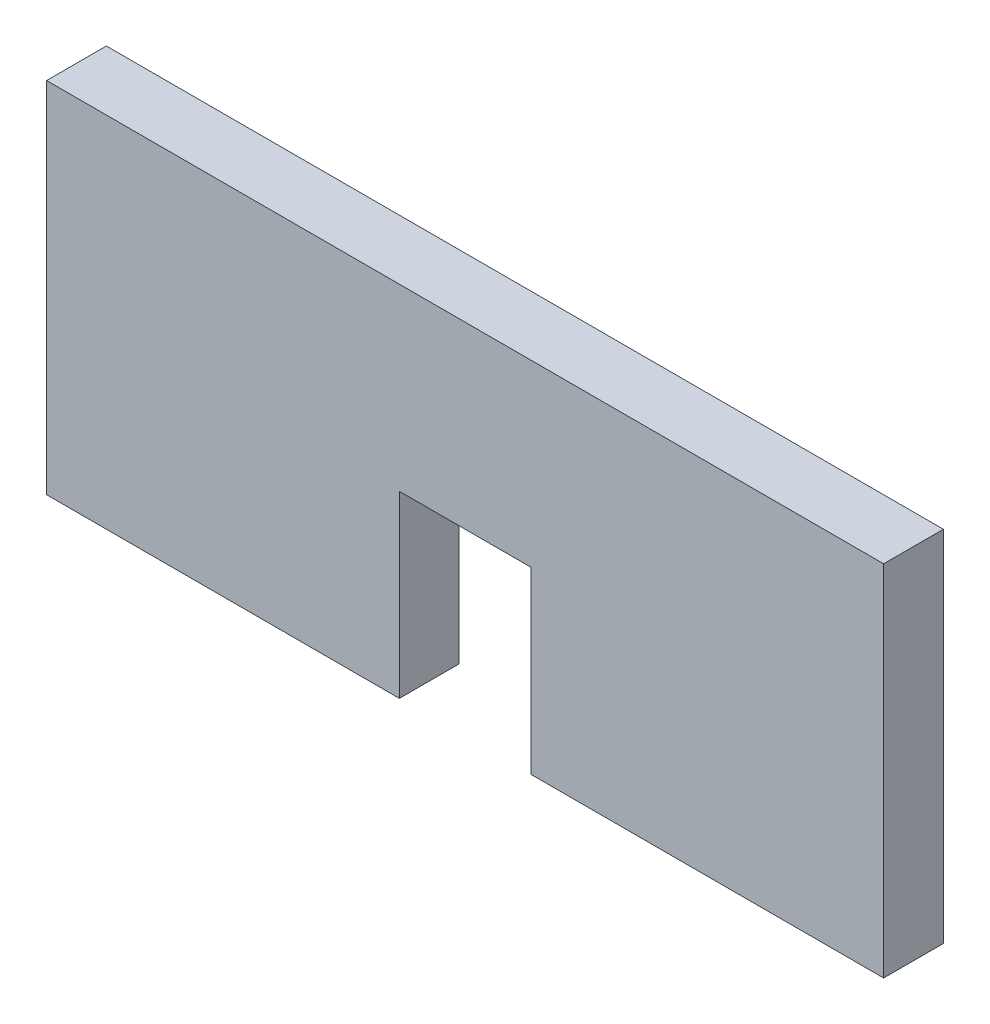
ISO-10303-21;
HEADER;
FILE_DESCRIPTION(('STEP AP214'),'2;1');
FILE_NAME('part.step','',(''),(''),'','','');
FILE_SCHEMA(('AUTOMOTIVE_DESIGN { 1 0 10303 214 1 1 1 1 }'));
ENDSEC;
DATA;
#1=APPLICATION_CONTEXT('core data for automotive mechanical design processes');
#2=APPLICATION_PROTOCOL_DEFINITION('international standard','automotive_design',2000,#1);
#3=PRODUCT_CONTEXT('',#1,'mechanical');
#4=PRODUCT('Part','Part','',(#3));
#5=PRODUCT_RELATED_PRODUCT_CATEGORY('part','',(#4));
#6=PRODUCT_DEFINITION_FORMATION('','',#4);
#7=PRODUCT_DEFINITION_CONTEXT('part definition',#1,'design');
#8=PRODUCT_DEFINITION('design','',#6,#7);
#9=PRODUCT_DEFINITION_SHAPE('','',#8);
#10=(LENGTH_UNIT() NAMED_UNIT(*) SI_UNIT(.MILLI.,.METRE.));
#11=(NAMED_UNIT(*) PLANE_ANGLE_UNIT() SI_UNIT($,.RADIAN.));
#12=(NAMED_UNIT(*) SI_UNIT($,.STERADIAN.) SOLID_ANGLE_UNIT());
#13=UNCERTAINTY_MEASURE_WITH_UNIT(LENGTH_MEASURE(1.E-05),#10,'distance_accuracy_value','');
#14=(GEOMETRIC_REPRESENTATION_CONTEXT(3) GLOBAL_UNCERTAINTY_ASSIGNED_CONTEXT((#13)) GLOBAL_UNIT_ASSIGNED_CONTEXT((#10,
#11,#12)) REPRESENTATION_CONTEXT('',''));
#15=CARTESIAN_POINT('',(0.,0.,0.));
#16=DIRECTION('',(0.,0.,1.));
#17=DIRECTION('',(1.,0.,0.));
#18=AXIS2_PLACEMENT_3D('',#15,#16,#17);
#19=CARTESIAN_POINT('',(-700.,300.,50.));
#20=DIRECTION('',(1.,0.,0.));
#21=DIRECTION('',(0.,0.,-1.));
#22=AXIS2_PLACEMENT_3D('',#19,#20,#21);
#23=PLANE('',#22);
#24=DIRECTION('',(0.,-1.,0.));
#25=VECTOR('',#24,1.);
#26=CARTESIAN_POINT('',(-700.,300.,0.));
#27=LINE('',#26,#25);
#28=CARTESIAN_POINT('',(-700.,300.,0.));
#29=VERTEX_POINT('',#28);
#30=CARTESIAN_POINT('',(-700.,0.,0.));
#31=VERTEX_POINT('',#30);
#32=EDGE_CURVE('E146',#29,#31,#27,.T.);
#33=ORIENTED_EDGE('',*,*,#32,.T.);
#34=DIRECTION('',(0.,0.,-1.));
#35=VECTOR('',#34,1.);
#36=CARTESIAN_POINT('',(-700.,0.,50.));
#37=LINE('',#36,#35);
#38=CARTESIAN_POINT('',(-700.,0.,50.));
#39=VERTEX_POINT('',#38);
#40=EDGE_CURVE('E11',#39,#31,#37,.T.);
#41=ORIENTED_EDGE('',*,*,#40,.F.);
#42=DIRECTION('',(0.,-1.,0.));
#43=VECTOR('',#42,1.);
#44=CARTESIAN_POINT('',(-700.,300.,50.));
#45=LINE('',#44,#43);
#46=CARTESIAN_POINT('',(-700.,300.,50.));
#47=VERTEX_POINT('',#46);
#48=EDGE_CURVE('E168',#47,#39,#45,.T.);
#49=ORIENTED_EDGE('',*,*,#48,.F.);
#50=DIRECTION('',(0.,0.,-1.));
#51=VECTOR('',#50,1.);
#52=CARTESIAN_POINT('',(-700.,300.,50.));
#53=LINE('',#52,#51);
#54=EDGE_CURVE('E142',#47,#29,#53,.T.);
#55=ORIENTED_EDGE('',*,*,#54,.T.);
#56=EDGE_LOOP('',(#33,#41,#49,#55));
#57=FACE_BOUND('',#56,.T.);
#58=ADVANCED_FACE('F45',(#57),#23,.F.);
#59=CARTESIAN_POINT('',(-700.,0.,50.));
#60=DIRECTION('',(0.,1.,0.));
#61=DIRECTION('',(-1.,0.,0.));
#62=AXIS2_PLACEMENT_3D('',#59,#60,#61);
#63=PLANE('',#62);
#64=DIRECTION('',(1.,0.,0.));
#65=VECTOR('',#64,1.);
#66=CARTESIAN_POINT('',(-700.,0.,0.));
#67=LINE('',#66,#65);
#68=CARTESIAN_POINT('',(-405.,0.,0.));
#69=VERTEX_POINT('',#68);
#70=EDGE_CURVE('E150',#31,#69,#67,.T.);
#71=ORIENTED_EDGE('',*,*,#70,.T.);
#72=DIRECTION('',(0.,0.,-1.));
#73=VECTOR('',#72,1.);
#74=CARTESIAN_POINT('',(-405.,0.,50.));
#75=LINE('',#74,#73);
#76=CARTESIAN_POINT('',(-405.,0.,50.));
#77=VERTEX_POINT('',#76);
#78=EDGE_CURVE('E54',#77,#69,#75,.T.);
#79=ORIENTED_EDGE('',*,*,#78,.F.);
#80=DIRECTION('',(1.,0.,0.));
#81=VECTOR('',#80,1.);
#82=CARTESIAN_POINT('',(-700.,0.,50.));
#83=LINE('',#82,#81);
#84=EDGE_CURVE('E105',#39,#77,#83,.T.);
#85=ORIENTED_EDGE('',*,*,#84,.F.);
#86=ORIENTED_EDGE('',*,*,#40,.T.);
#87=EDGE_LOOP('',(#71,#79,#85,#86));
#88=FACE_BOUND('',#87,.T.);
#89=ADVANCED_FACE('F214',(#88),#63,.F.);
#90=CARTESIAN_POINT('',(-405.,150.,50.));
#91=DIRECTION('',(-1.,0.,0.));
#92=DIRECTION('',(0.,0.,1.));
#93=AXIS2_PLACEMENT_3D('',#90,#91,#92);
#94=PLANE('',#93);
#95=DIRECTION('',(0.,1.,0.));
#96=VECTOR('',#95,1.);
#97=CARTESIAN_POINT('',(-405.,150.,0.));
#98=LINE('',#97,#96);
#99=CARTESIAN_POINT('',(-405.,150.,0.));
#100=VERTEX_POINT('',#99);
#101=EDGE_CURVE('E153',#69,#100,#98,.T.);
#102=ORIENTED_EDGE('',*,*,#101,.T.);
#103=DIRECTION('',(0.,0.,-1.));
#104=VECTOR('',#103,1.);
#105=CARTESIAN_POINT('',(-405.,150.,50.));
#106=LINE('',#105,#104);
#107=CARTESIAN_POINT('',(-405.,150.,50.));
#108=VERTEX_POINT('',#107);
#109=EDGE_CURVE('E179',#108,#100,#106,.T.);
#110=ORIENTED_EDGE('',*,*,#109,.F.);
#111=DIRECTION('',(0.,1.,0.));
#112=VECTOR('',#111,1.);
#113=CARTESIAN_POINT('',(-405.,150.,50.));
#114=LINE('',#113,#112);
#115=EDGE_CURVE('E189',#77,#108,#114,.T.);
#116=ORIENTED_EDGE('',*,*,#115,.F.);
#117=ORIENTED_EDGE('',*,*,#78,.T.);
#118=EDGE_LOOP('',(#102,#110,#116,#117));
#119=FACE_BOUND('',#118,.T.);
#120=ADVANCED_FACE('F187',(#119),#94,.F.);
#121=CARTESIAN_POINT('',(-405.,150.,50.));
#122=DIRECTION('',(0.,1.,0.));
#123=DIRECTION('',(-1.,0.,0.));
#124=AXIS2_PLACEMENT_3D('',#121,#122,#123);
#125=PLANE('',#124);
#126=DIRECTION('',(1.,0.,0.));
#127=VECTOR('',#126,1.);
#128=CARTESIAN_POINT('',(-405.,150.,0.));
#129=LINE('',#128,#127);
#130=CARTESIAN_POINT('',(-295.,150.,0.));
#131=VERTEX_POINT('',#130);
#132=EDGE_CURVE('E156',#100,#131,#129,.T.);
#133=ORIENTED_EDGE('',*,*,#132,.T.);
#134=DIRECTION('',(0.,0.,-1.));
#135=VECTOR('',#134,1.);
#136=CARTESIAN_POINT('',(-295.,150.,50.));
#137=LINE('',#136,#135);
#138=CARTESIAN_POINT('',(-295.,150.,50.));
#139=VERTEX_POINT('',#138);
#140=EDGE_CURVE('E175',#139,#131,#137,.T.);
#141=ORIENTED_EDGE('',*,*,#140,.F.);
#142=DIRECTION('',(1.,0.,0.));
#143=VECTOR('',#142,1.);
#144=CARTESIAN_POINT('',(-405.,150.,50.));
#145=LINE('',#144,#143);
#146=EDGE_CURVE('E202',#108,#139,#145,.T.);
#147=ORIENTED_EDGE('',*,*,#146,.F.);
#148=ORIENTED_EDGE('',*,*,#109,.T.);
#149=EDGE_LOOP('',(#133,#141,#147,#148));
#150=FACE_BOUND('',#149,.T.);
#151=ADVANCED_FACE('F197',(#150),#125,.F.);
#152=CARTESIAN_POINT('',(-295.,150.,50.));
#153=DIRECTION('',(1.,0.,0.));
#154=DIRECTION('',(0.,0.,-1.));
#155=AXIS2_PLACEMENT_3D('',#152,#153,#154);
#156=PLANE('',#155);
#157=DIRECTION('',(0.,-1.,0.));
#158=VECTOR('',#157,1.);
#159=CARTESIAN_POINT('',(-295.,150.,0.));
#160=LINE('',#159,#158);
#161=CARTESIAN_POINT('',(-295.,0.,0.));
#162=VERTEX_POINT('',#161);
#163=EDGE_CURVE('E159',#131,#162,#160,.T.);
#164=ORIENTED_EDGE('',*,*,#163,.T.);
#165=DIRECTION('',(0.,0.,-1.));
#166=VECTOR('',#165,1.);
#167=CARTESIAN_POINT('',(-295.,0.,50.));
#168=LINE('',#167,#166);
#169=CARTESIAN_POINT('',(-295.,0.,50.));
#170=VERTEX_POINT('',#169);
#171=EDGE_CURVE('E135',#170,#162,#168,.T.);
#172=ORIENTED_EDGE('',*,*,#171,.F.);
#173=DIRECTION('',(0.,-1.,0.));
#174=VECTOR('',#173,1.);
#175=CARTESIAN_POINT('',(-295.,150.,50.));
#176=LINE('',#175,#174);
#177=EDGE_CURVE('E124',#139,#170,#176,.T.);
#178=ORIENTED_EDGE('',*,*,#177,.F.);
#179=ORIENTED_EDGE('',*,*,#140,.T.);
#180=EDGE_LOOP('',(#164,#172,#178,#179));
#181=FACE_BOUND('',#180,.T.);
#182=ADVANCED_FACE('F200',(#181),#156,.F.);
#183=CARTESIAN_POINT('',(-295.,0.,50.));
#184=DIRECTION('',(0.,1.,0.));
#185=DIRECTION('',(0.,0.,1.));
#186=AXIS2_PLACEMENT_3D('',#183,#184,#185);
#187=PLANE('',#186);
#188=DIRECTION('',(1.,0.,0.));
#189=VECTOR('',#188,1.);
#190=CARTESIAN_POINT('',(-295.,0.,0.));
#191=LINE('',#190,#189);
#192=CARTESIAN_POINT('',(0.,0.,0.));
#193=VERTEX_POINT('',#192);
#194=EDGE_CURVE('E133',#162,#193,#191,.T.);
#195=ORIENTED_EDGE('',*,*,#194,.T.);
#196=DIRECTION('',(0.,0.,-1.));
#197=VECTOR('',#196,1.);
#198=CARTESIAN_POINT('',(0.,0.,50.));
#199=LINE('',#198,#197);
#200=CARTESIAN_POINT('',(0.,0.,50.));
#201=VERTEX_POINT('',#200);
#202=EDGE_CURVE('E130',#201,#193,#199,.T.);
#203=ORIENTED_EDGE('',*,*,#202,.F.);
#204=DIRECTION('',(1.,0.,0.));
#205=VECTOR('',#204,1.);
#206=CARTESIAN_POINT('',(-295.,0.,50.));
#207=LINE('',#206,#205);
#208=EDGE_CURVE('E118',#170,#201,#207,.T.);
#209=ORIENTED_EDGE('',*,*,#208,.F.);
#210=ORIENTED_EDGE('',*,*,#171,.T.);
#211=EDGE_LOOP('',(#195,#203,#209,#210));
#212=FACE_BOUND('',#211,.T.);
#213=ADVANCED_FACE('F131',(#212),#187,.F.);
#214=CARTESIAN_POINT('',(0.,300.,50.));
#215=DIRECTION('',(-1.,0.,0.));
#216=DIRECTION('',(0.,0.,1.));
#217=AXIS2_PLACEMENT_3D('',#214,#215,#216);
#218=PLANE('',#217);
#219=DIRECTION('',(0.,1.,0.));
#220=VECTOR('',#219,1.);
#221=CARTESIAN_POINT('',(0.,300.,0.));
#222=LINE('',#221,#220);
#223=CARTESIAN_POINT('',(0.,300.,0.));
#224=VERTEX_POINT('',#223);
#225=EDGE_CURVE('E91',#193,#224,#222,.T.);
#226=ORIENTED_EDGE('',*,*,#225,.T.);
#227=DIRECTION('',(0.,0.,-1.));
#228=VECTOR('',#227,1.);
#229=CARTESIAN_POINT('',(0.,300.,50.));
#230=LINE('',#229,#228);
#231=CARTESIAN_POINT('',(0.,300.,50.));
#232=VERTEX_POINT('',#231);
#233=EDGE_CURVE('E136',#232,#224,#230,.T.);
#234=ORIENTED_EDGE('',*,*,#233,.F.);
#235=DIRECTION('',(0.,1.,0.));
#236=VECTOR('',#235,1.);
#237=CARTESIAN_POINT('',(0.,300.,50.));
#238=LINE('',#237,#236);
#239=EDGE_CURVE('E122',#201,#232,#238,.T.);
#240=ORIENTED_EDGE('',*,*,#239,.F.);
#241=ORIENTED_EDGE('',*,*,#202,.T.);
#242=EDGE_LOOP('',(#226,#234,#240,#241));
#243=FACE_BOUND('',#242,.T.);
#244=ADVANCED_FACE('F138',(#243),#218,.F.);
#245=CARTESIAN_POINT('',(-700.,300.,50.));
#246=DIRECTION('',(0.,-1.,0.));
#247=DIRECTION('',(1.,0.,0.));
#248=AXIS2_PLACEMENT_3D('',#245,#246,#247);
#249=PLANE('',#248);
#250=DIRECTION('',(-1.,0.,0.));
#251=VECTOR('',#250,1.);
#252=CARTESIAN_POINT('',(-700.,300.,0.));
#253=LINE('',#252,#251);
#254=EDGE_CURVE('E97',#224,#29,#253,.T.);
#255=ORIENTED_EDGE('',*,*,#254,.T.);
#256=ORIENTED_EDGE('',*,*,#54,.F.);
#257=DIRECTION('',(-1.,0.,0.));
#258=VECTOR('',#257,1.);
#259=CARTESIAN_POINT('',(-700.,300.,50.));
#260=LINE('',#259,#258);
#261=EDGE_CURVE('E62',#232,#47,#260,.T.);
#262=ORIENTED_EDGE('',*,*,#261,.F.);
#263=ORIENTED_EDGE('',*,*,#233,.T.);
#264=EDGE_LOOP('',(#255,#256,#262,#263));
#265=FACE_BOUND('',#264,.T.);
#266=ADVANCED_FACE('F230',(#265),#249,.F.);
#267=CARTESIAN_POINT('',(0.,0.,50.));
#268=DIRECTION('',(0.,0.,1.));
#269=DIRECTION('',(1.,0.,0.));
#270=AXIS2_PLACEMENT_3D('',#267,#268,#269);
#271=PLANE('',#270);
#272=ORIENTED_EDGE('',*,*,#48,.T.);
#273=ORIENTED_EDGE('',*,*,#84,.T.);
#274=ORIENTED_EDGE('',*,*,#115,.T.);
#275=ORIENTED_EDGE('',*,*,#146,.T.);
#276=ORIENTED_EDGE('',*,*,#177,.T.);
#277=ORIENTED_EDGE('',*,*,#208,.T.);
#278=ORIENTED_EDGE('',*,*,#239,.T.);
#279=ORIENTED_EDGE('',*,*,#261,.T.);
#280=EDGE_LOOP('',(#272,#273,#274,#275,#276,#277,#278,#279));
#281=FACE_BOUND('',#280,.T.);
#282=ADVANCED_FACE('F120',(#281),#271,.T.);
#283=CARTESIAN_POINT('',(0.,0.,0.));
#284=DIRECTION('',(0.,0.,1.));
#285=DIRECTION('',(1.,0.,0.));
#286=AXIS2_PLACEMENT_3D('',#283,#284,#285);
#287=PLANE('',#286);
#288=ORIENTED_EDGE('',*,*,#32,.F.);
#289=ORIENTED_EDGE('',*,*,#254,.F.);
#290=ORIENTED_EDGE('',*,*,#225,.F.);
#291=ORIENTED_EDGE('',*,*,#194,.F.);
#292=ORIENTED_EDGE('',*,*,#163,.F.);
#293=ORIENTED_EDGE('',*,*,#132,.F.);
#294=ORIENTED_EDGE('',*,*,#101,.F.);
#295=ORIENTED_EDGE('',*,*,#70,.F.);
#296=EDGE_LOOP('',(#288,#289,#290,#291,#292,#293,#294,#295));
#297=FACE_BOUND('',#296,.T.);
#298=ADVANCED_FACE('F193',(#297),#287,.F.);
#299=CLOSED_SHELL('',(#58,#89,#120,#151,#182,#213,#244,#266,#282,#298));
#300=MANIFOLD_SOLID_BREP('B2',#299);
#301=ADVANCED_BREP_SHAPE_REPRESENTATION('',(#18,#300),#14);
#302=SHAPE_DEFINITION_REPRESENTATION(#9,#301);
ENDSEC;
END-ISO-10303-21;
